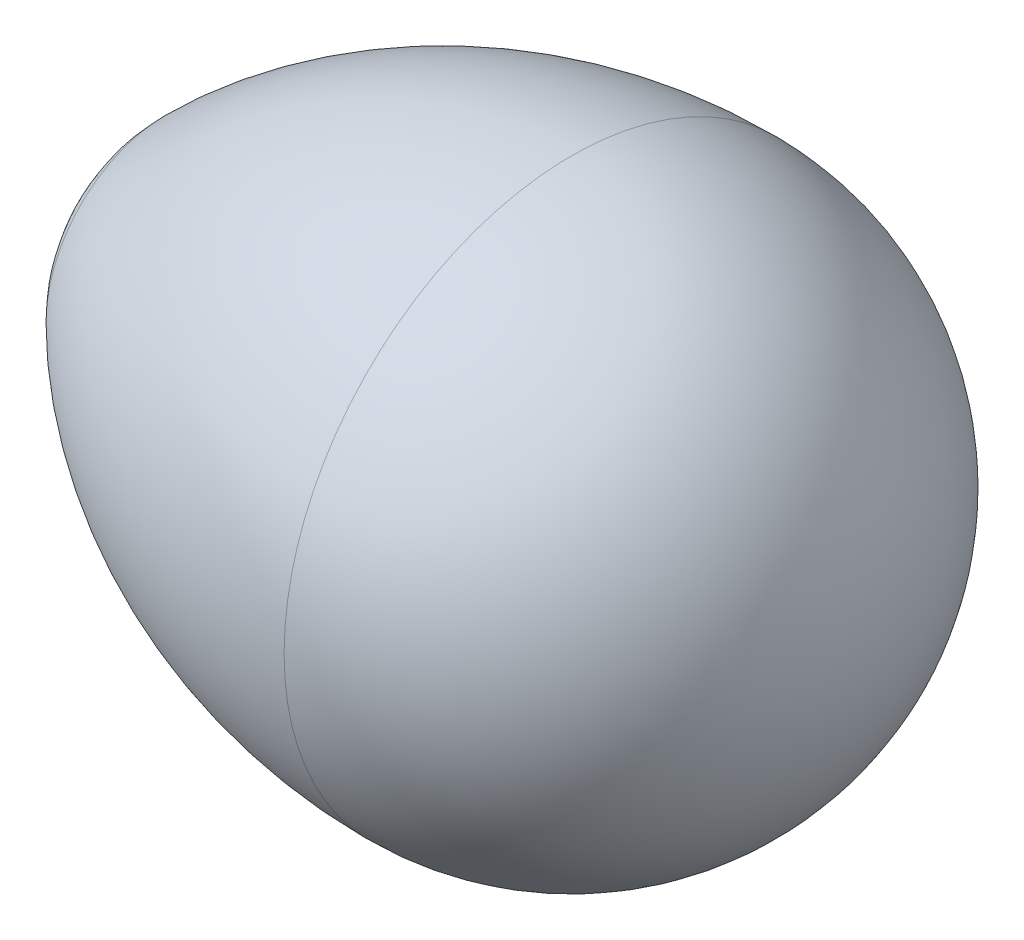
ISO-10303-21;
HEADER;
FILE_DESCRIPTION(('STEP AP214'),'2;1');
FILE_NAME('part.step','',(''),(''),'','','');
FILE_SCHEMA(('AUTOMOTIVE_DESIGN { 1 0 10303 214 1 1 1 1 }'));
ENDSEC;
DATA;
#1=APPLICATION_CONTEXT('core data for automotive mechanical design processes');
#2=APPLICATION_PROTOCOL_DEFINITION('international standard','automotive_design',2000,#1);
#3=PRODUCT_CONTEXT('',#1,'mechanical');
#4=PRODUCT('Part','Part','',(#3));
#5=PRODUCT_RELATED_PRODUCT_CATEGORY('part','',(#4));
#6=PRODUCT_DEFINITION_FORMATION('','',#4);
#7=PRODUCT_DEFINITION_CONTEXT('part definition',#1,'design');
#8=PRODUCT_DEFINITION('design','',#6,#7);
#9=PRODUCT_DEFINITION_SHAPE('','',#8);
#10=(LENGTH_UNIT() NAMED_UNIT(*) SI_UNIT(.MILLI.,.METRE.));
#11=(NAMED_UNIT(*) PLANE_ANGLE_UNIT() SI_UNIT($,.RADIAN.));
#12=(NAMED_UNIT(*) SI_UNIT($,.STERADIAN.) SOLID_ANGLE_UNIT());
#13=UNCERTAINTY_MEASURE_WITH_UNIT(LENGTH_MEASURE(1.E-05),#10,'distance_accuracy_value','');
#14=(GEOMETRIC_REPRESENTATION_CONTEXT(3) GLOBAL_UNCERTAINTY_ASSIGNED_CONTEXT((#13)) GLOBAL_UNIT_ASSIGNED_CONTEXT((#10,
#11,#12)) REPRESENTATION_CONTEXT('',''));
#15=CARTESIAN_POINT('',(0.,0.,0.));
#16=DIRECTION('',(0.,0.,1.));
#17=DIRECTION('',(1.,0.,0.));
#18=AXIS2_PLACEMENT_3D('',#15,#16,#17);
#19=CARTESIAN_POINT('',(-25.,0.,0.));
#20=DIRECTION('',(-1.,0.,0.));
#21=DIRECTION('',(0.,0.,-1.));
#22=AXIS2_PLACEMENT_3D('',#19,#20,#21);
#23=SPHERICAL_SURFACE('',#22,7.32233047033632);
#24=CARTESIAN_POINT('',(-30.1776695296637,0.,0.));
#25=DIRECTION('',(-1.,0.,0.));
#26=DIRECTION('',(0.,0.,1.));
#27=AXIS2_PLACEMENT_3D('',#24,#25,#26);
#28=CIRCLE('',#27,5.17766952966368);
#29=CARTESIAN_POINT('',(-30.1776695296637,0.,5.17766952966368));
#30=VERTEX_POINT('',#29);
#31=EDGE_CURVE('E10',#30,#30,#28,.T.);
#32=ORIENTED_EDGE('',*,*,#31,.T.);
#33=EDGE_LOOP('',(#32));
#34=FACE_BOUND('',#33,.T.);
#35=ADVANCED_FACE('F37',(#34),#23,.T.);
#36=CARTESIAN_POINT('',(-12.5,0.,0.));
#37=DIRECTION('',(-1.,0.,0.));
#38=DIRECTION('',(0.,0.,1.));
#39=AXIS2_PLACEMENT_3D('',#36,#37,#38);
#40=DEGENERATE_TOROIDAL_SURFACE('',#39,12.5,25.,.F.);
#41=ORIENTED_EDGE('',*,*,#31,.F.);
#42=EDGE_LOOP('',(#41));
#43=FACE_BOUND('',#42,.T.);
#44=CARTESIAN_POINT('',(-12.5,0.,0.));
#45=DIRECTION('',(-1.,0.,0.));
#46=DIRECTION('',(0.,0.,1.));
#47=AXIS2_PLACEMENT_3D('',#44,#45,#46);
#48=CIRCLE('',#47,12.5);
#49=CARTESIAN_POINT('',(-12.5,0.,12.5));
#50=VERTEX_POINT('',#49);
#51=EDGE_CURVE('E43',#50,#50,#48,.T.);
#52=ORIENTED_EDGE('',*,*,#51,.T.);
#53=EDGE_LOOP('',(#52));
#54=FACE_BOUND('',#53,.T.);
#55=ADVANCED_FACE('F49',(#43,#54),#40,.F.);
#56=CARTESIAN_POINT('',(-12.5,0.,0.));
#57=DIRECTION('',(-1.,0.,0.));
#58=DIRECTION('',(0.,0.,-1.));
#59=AXIS2_PLACEMENT_3D('',#56,#57,#58);
#60=SPHERICAL_SURFACE('',#59,12.5);
#61=ORIENTED_EDGE('',*,*,#51,.F.);
#62=EDGE_LOOP('',(#61));
#63=FACE_BOUND('',#62,.T.);
#64=ADVANCED_FACE('F51',(#63),#60,.T.);
#65=CLOSED_SHELL('',(#35,#55,#64));
#66=MANIFOLD_SOLID_BREP('B2',#65);
#67=ADVANCED_BREP_SHAPE_REPRESENTATION('',(#18,#66),#14);
#68=SHAPE_DEFINITION_REPRESENTATION(#9,#67);
ENDSEC;
END-ISO-10303-21;
